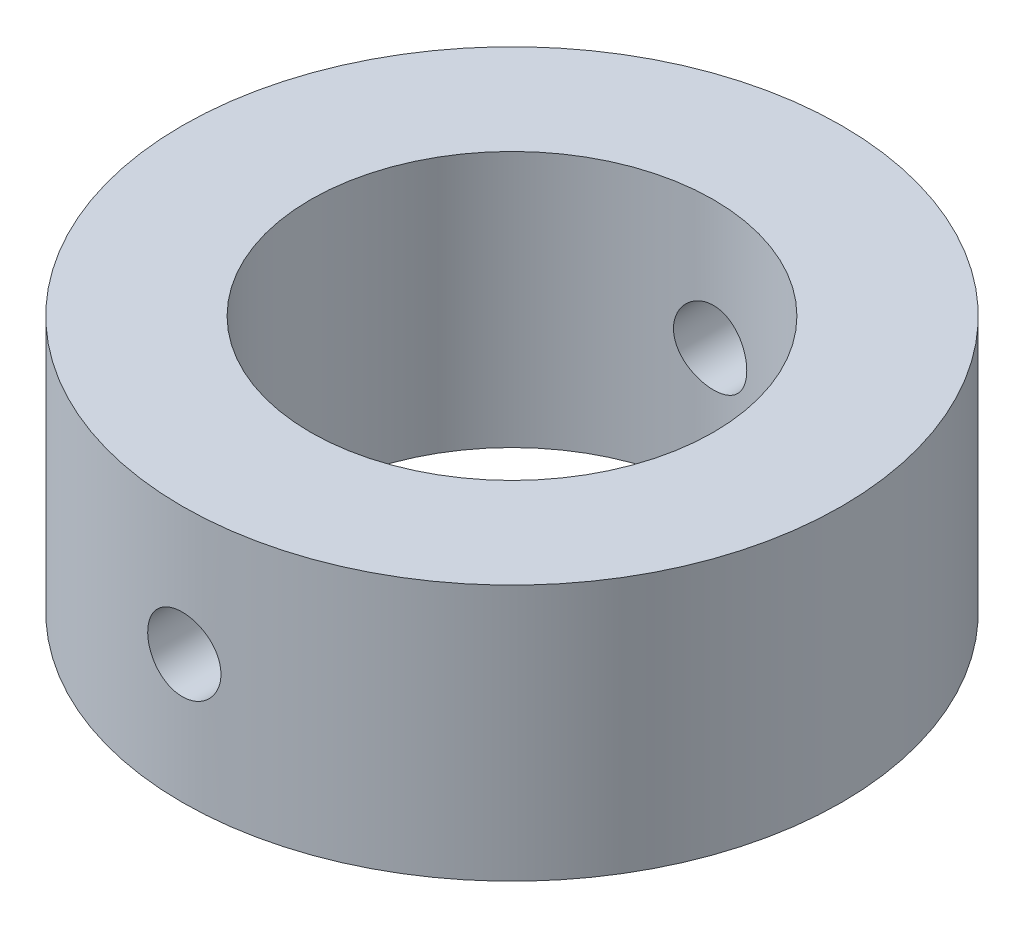
ISO-10303-21;
HEADER;
FILE_DESCRIPTION(('STEP AP214'),'2;1');
FILE_NAME('part.step','',(''),(''),'','','');
FILE_SCHEMA(('AUTOMOTIVE_DESIGN { 1 0 10303 214 1 1 1 1 }'));
ENDSEC;
DATA;
#1=APPLICATION_CONTEXT('core data for automotive mechanical design processes');
#2=APPLICATION_PROTOCOL_DEFINITION('international standard','automotive_design',2000,#1);
#3=PRODUCT_CONTEXT('',#1,'mechanical');
#4=PRODUCT('Part','Part','',(#3));
#5=PRODUCT_RELATED_PRODUCT_CATEGORY('part','',(#4));
#6=PRODUCT_DEFINITION_FORMATION('','',#4);
#7=PRODUCT_DEFINITION_CONTEXT('part definition',#1,'design');
#8=PRODUCT_DEFINITION('design','',#6,#7);
#9=PRODUCT_DEFINITION_SHAPE('','',#8);
#10=(LENGTH_UNIT() NAMED_UNIT(*) SI_UNIT(.MILLI.,.METRE.));
#11=(NAMED_UNIT(*) PLANE_ANGLE_UNIT() SI_UNIT($,.RADIAN.));
#12=(NAMED_UNIT(*) SI_UNIT($,.STERADIAN.) SOLID_ANGLE_UNIT());
#13=UNCERTAINTY_MEASURE_WITH_UNIT(LENGTH_MEASURE(1.E-05),#10,'distance_accuracy_value','');
#14=(GEOMETRIC_REPRESENTATION_CONTEXT(3) GLOBAL_UNCERTAINTY_ASSIGNED_CONTEXT((#13)) GLOBAL_UNIT_ASSIGNED_CONTEXT((#10,
#11,#12)) REPRESENTATION_CONTEXT('',''));
#15=CARTESIAN_POINT('',(0.,0.,0.));
#16=DIRECTION('',(0.,0.,1.));
#17=DIRECTION('',(1.,0.,0.));
#18=AXIS2_PLACEMENT_3D('',#15,#16,#17);
#19=CARTESIAN_POINT('',(0.,17.5538461538461,0.));
#20=DIRECTION('',(0.,1.,0.));
#21=DIRECTION('',(0.,0.,1.));
#22=AXIS2_PLACEMENT_3D('',#19,#20,#21);
#23=CYLINDRICAL_SURFACE('',#22,18.);
#24=CARTESIAN_POINT('',(0.,-2.,18.));
#25=CARTESIAN_POINT('',(-0.111970632349519,-1.99999518717274,17.9999985855436));
#26=CARTESIAN_POINT('',(-0.22401360296951,-1.99056525489512,17.9989441411048));
#27=CARTESIAN_POINT('',(-0.444988473846702,-1.95309247157582,17.9948391595619));
#28=CARTESIAN_POINT('',(-0.553916889117786,-1.92502956094916,17.9917864712715));
#29=CARTESIAN_POINT('',(-0.765431079070291,-1.85112204481784,17.9840293073923));
#30=CARTESIAN_POINT('',(-0.868020820737628,-1.8052886941403,17.9793258774716));
#31=CARTESIAN_POINT('',(-1.06403053009986,-1.69716438580146,17.9687919810869));
#32=CARTESIAN_POINT('',(-1.1574522117349,-1.63487651233084,17.9629617258869));
#33=CARTESIAN_POINT('',(-1.33290575747026,-1.49531794987183,17.9507977181856));
#34=CARTESIAN_POINT('',(-1.4148915795421,-1.41798953514322,17.9444620831364));
#35=CARTESIAN_POINT('',(-1.56475003710051,-1.2506685239635,17.9320167832537));
#36=CARTESIAN_POINT('',(-1.63262199299226,-1.16067531804146,17.9259071293129));
#37=CARTESIAN_POINT('',(-1.7524930181623,-0.970286071769773,17.9145866794937));
#38=CARTESIAN_POINT('',(-1.80444975542339,-0.869863222950149,17.9093782965755));
#39=CARTESIAN_POINT('',(-1.89074517800796,-0.661650539312929,17.9004741803531));
#40=CARTESIAN_POINT('',(-1.92508439501976,-0.553860926931999,17.8967784014));
#41=CARTESIAN_POINT('',(-1.97503194492644,-0.334448002135696,17.8913354423153));
#42=CARTESIAN_POINT('',(-1.99071729842217,-0.222842424929062,17.8895802517469));
#43=CARTESIAN_POINT('',(-2.00315006003506,0.00142986183008502,17.8881925066123));
#44=CARTESIAN_POINT('',(-1.99989807564483,0.114096537227774,17.8885598839559));
#45=CARTESIAN_POINT('',(-1.97461184427901,0.336759474971588,17.891368441014));
#46=CARTESIAN_POINT('',(-1.95266200172973,0.446765456674598,17.8938003012309));
#47=CARTESIAN_POINT('',(-1.89073461157689,0.661522625388757,17.9004492717341));
#48=CARTESIAN_POINT('',(-1.85075676930152,0.766273726476568,17.904666411201));
#49=CARTESIAN_POINT('',(-1.75381606079451,0.967812423163108,17.9144214425039));
#50=CARTESIAN_POINT('',(-1.6968160688148,1.06458201601582,17.9199622158801));
#51=CARTESIAN_POINT('',(-1.56747570663675,1.24721365073087,17.9317378723191));
#52=CARTESIAN_POINT('',(-1.49513478176794,1.33307529802335,17.9379727804753));
#53=CARTESIAN_POINT('',(-1.33669614893956,1.49194398430861,17.9504756897929));
#54=CARTESIAN_POINT('',(-1.25052560566827,1.56487840522475,17.9567436860931));
#55=CARTESIAN_POINT('',(-1.06712581996098,1.69525838167234,17.9685745710182));
#56=CARTESIAN_POINT('',(-0.969896560277035,1.75270391304576,17.9741374585434));
#57=CARTESIAN_POINT('',(-0.767086635535504,1.85047376476476,17.9839338102592));
#58=CARTESIAN_POINT('',(-0.661504004801704,1.89079404097506,17.9881669603705));
#59=CARTESIAN_POINT('',(-0.445009755639361,1.95311377504167,17.9948238450129));
#60=CARTESIAN_POINT('',(-0.334098334257908,1.97511390978633,17.997247646395));
#61=CARTESIAN_POINT('',(-0.110723331894269,2.00007590171753,18.0000041106556));
#62=CARTESIAN_POINT('',(0.00172892889089294,2.00313789379621,18.0003477720089));
#63=CARTESIAN_POINT('',(0.225544988687161,1.99040020748693,17.998934812043));
#64=CARTESIAN_POINT('',(0.33690880589132,1.97460084490708,17.9971782258895));
#65=CARTESIAN_POINT('',(0.555095059423331,1.92467205954415,17.9917690933051));
#66=CARTESIAN_POINT('',(0.661928438561836,1.89058988188252,17.9881214344582));
#67=CARTESIAN_POINT('',(0.868362270126896,1.80511172227189,17.9793390034163));
#68=CARTESIAN_POINT('',(0.967962524792293,1.75371526714897,17.9742041905801));
#69=CARTESIAN_POINT('',(1.15755326511746,1.63482170892903,17.9629935700227));
#70=CARTESIAN_POINT('',(1.24750253139102,1.56725923906018,17.9569139780361));
#71=CARTESIAN_POINT('',(1.41481983480219,1.41804470166563,17.9445071585437));
#72=CARTESIAN_POINT('',(1.49218748015557,1.33639219554766,17.938179923334));
#73=CARTESIAN_POINT('',(1.63249622432816,1.16087671093394,17.925957484036));
#74=CARTESIAN_POINT('',(1.69537132537921,1.06696080952172,17.920064336427));
#75=CARTESIAN_POINT('',(1.80445556005008,0.869843716507564,17.9094097287311));
#76=CARTESIAN_POINT('',(1.85066496700075,0.766642677224086,17.9046482500845));
#77=CARTESIAN_POINT('',(1.92499712101143,0.554105541283379,17.8968094822665));
#78=CARTESIAN_POINT('',(1.95315827481128,0.44478301425242,17.8937286188355));
#79=CARTESIAN_POINT('',(1.99071877766797,0.222924852258367,17.8895891957456));
#80=CARTESIAN_POINT('',(2.00011880320655,0.11038933329655,17.8885305631698));
#81=CARTESIAN_POINT('',(1.99987957341679,-0.114044155065053,17.8885572584665));
#82=CARTESIAN_POINT('',(1.99034399043058,-0.225942250680951,17.8896309120887));
#83=CARTESIAN_POINT('',(1.9527225008048,-0.446535738325604,17.8937762295707));
#84=CARTESIAN_POINT('',(1.92463658036714,-0.555231127972063,17.8968478949167));
#85=CARTESIAN_POINT('',(1.85074191262564,-0.766327510509217,17.9046397451111));
#86=CARTESIAN_POINT('',(1.80493703938195,-0.868729873635424,17.9093595695852));
#87=CARTESIAN_POINT('',(1.69691508787252,-1.0644104934481,17.9199166120206));
#88=CARTESIAN_POINT('',(1.63469797623759,-1.15768873158296,17.9257538322538));
#89=CARTESIAN_POINT('',(1.49522995253707,-1.33300424612643,17.9379262794022));
#90=CARTESIAN_POINT('',(1.41790170900318,-1.41497983547593,17.944263963574));
#91=CARTESIAN_POINT('',(1.25056419248413,-1.5648338722108,17.9567010614173));
#92=CARTESIAN_POINT('',(1.16055190760651,-1.63270896185917,17.962800418056));
#93=CARTESIAN_POINT('',(0.970094486774868,-1.75260433035013,17.9740935209669));
#94=CARTESIAN_POINT('',(0.869618446416091,-1.80457574973094,17.9792844558708));
#95=CARTESIAN_POINT('',(0.66136849516123,-1.89083749244483,17.9881463543356));
#96=CARTESIAN_POINT('',(0.55360283994444,-1.92514745073418,17.9918190049356));
#97=CARTESIAN_POINT('',(0.371040239312598,-1.96669916146577,17.9963232552591));
#98=CARTESIAN_POINT('',(0.297404134861362,-1.97916954843922,17.9976954860037));
#99=CARTESIAN_POINT('',(0.149189389902707,-1.99582154886399,17.9995343271896));
#100=CARTESIAN_POINT('',(0.0746107544775069,-2.00000320698978,18.000000942512));
#101=CARTESIAN_POINT('',(0.,-2.,18.));
#102=B_SPLINE_CURVE_WITH_KNOTS('',3,(#24,#25,#26,#27,#28,#29,#30,#31,#32,#33,#34,#35,#36,#37,
#38,#39,#40,#41,#42,#43,#44,#45,#46,#47,#48,#49,#50,#51,#52,#53,#54,#55,#56,#57,#58,#59,#60,#61,
#62,#63,#64,#65,#66,#67,#68,#69,#70,#71,#72,#73,#74,#75,#76,#77,#78,#79,#80,#81,#82,#83,#84,#85,
#86,#87,#88,#89,#90,#91,#92,#93,#94,#95,#96,#97,#98,#99,#100,#101),.UNSPECIFIED.,.T.,.F.,(4,2,2,
2,2,2,2,2,2,2,2,2,2,2,2,2,2,2,2,2,2,2,2,2,2,2,2,2,2,2,2,2,2,2,2,2,2,2,4),(0.,0.335639414270807,
0.671640752838988,1.00742963320074,1.34315561881719,1.68019649784365,2.01725360192296,
2.35519959306228,2.69313538455338,3.02967096220247,3.36619574415512,3.70120941343134,
4.03622855878184,4.37198379333011,4.70775116959619,5.0453487253329,5.3829468076176,
5.72062456954608,6.05828985448105,6.39416820670407,6.73004093517319,7.06504987759405,
7.40006797606269,7.73646430887643,8.07287111486782,8.41078088557856,8.74868511404414,
9.08586787252136,9.42303847276942,9.75836815539861,10.0936980874527,10.4289547445926,
10.7642120833782,11.1012322946639,11.4383326684529,11.7764585228658,12.1142076528796,
12.3378595549845,12.5615102516508),.UNSPECIFIED.);
#103=CARTESIAN_POINT('',(0.,-2.,18.));
#104=VERTEX_POINT('',#103);
#105=EDGE_CURVE('E92',#104,#104,#102,.T.);
#106=ORIENTED_EDGE('',*,*,#105,.T.);
#107=EDGE_LOOP('',(#106));
#108=FACE_BOUND('',#107,.T.);
#109=CARTESIAN_POINT('',(2.,0.,-17.8885438199983));
#110=CARTESIAN_POINT('',(1.99999518503575,0.111968226954188,-17.8885452673513));
#111=CARTESIAN_POINT('',(1.99056564422495,0.22400879952899,-17.8896064083062));
#112=CARTESIAN_POINT('',(1.9530945571327,0.444978688113826,-17.8937353069379));
#113=CARTESIAN_POINT('',(1.92503294287933,0.553904517249662,-17.8968052281518));
#114=CARTESIAN_POINT('',(1.85112921882987,0.765413238050207,-17.9045997629771));
#115=CARTESIAN_POINT('',(1.80529842543048,0.868000118596708,-17.9093233232741));
#116=CARTESIAN_POINT('',(1.6971801398522,1.0640050312931,-17.9198916263535));
#117=CARTESIAN_POINT('',(1.63489572561389,1.15742477384015,-17.9257361593821));
#118=CARTESIAN_POINT('',(1.49534066211955,1.33288049818134,-17.9379170304468));
#119=CARTESIAN_POINT('',(1.41801151386004,1.41486982635829,-17.9442552283822));
#120=CARTESIAN_POINT('',(1.25068756201248,1.56473505390659,-17.956692464558));
#121=CARTESIAN_POINT('',(1.16069215853742,1.6326102844422,-17.9627914914535));
#122=CARTESIAN_POINT('',(0.970300975910865,1.75248474260362,-17.9740818874251));
#123=CARTESIAN_POINT('',(0.869878766261949,1.80444223723359,-17.9792708555609));
#124=CARTESIAN_POINT('',(0.661667471517998,1.89073923619886,-17.9881361419533));
#125=CARTESIAN_POINT('',(0.553878605135573,1.92507926333131,-17.9918125050956));
#126=CARTESIAN_POINT('',(0.334468008621896,1.97502849322176,-17.9972252779851));
#127=CARTESIAN_POINT('',(0.222864029559306,1.99071479178831,-17.9989696704928));
#128=CARTESIAN_POINT('',(-0.00140512478551102,2.00314999730295,-18.0003491557537));
#129=CARTESIAN_POINT('',(-0.114070266492344,1.99989950141874,-17.999984315021));
#130=CARTESIAN_POINT('',(-0.336739745879572,1.97461563521794,-17.9971929428148));
#131=CARTESIAN_POINT('',(-0.446753627473802,1.95266517064822,-17.9947755115965));
#132=CARTESIAN_POINT('',(-0.661526274498665,1.89073380147306,-17.9881609397357));
#133=CARTESIAN_POINT('',(-0.766284958137244,1.85075261633365,-17.983963771403));
#134=CARTESIAN_POINT('',(-0.967832879518122,1.75380496878332,-17.9742457977887));
#135=CARTESIAN_POINT('',(-1.06460449111718,1.69680215768824,-17.9687221649126));
#136=CARTESIAN_POINT('',(-1.2472389694308,1.56745576931318,-17.9569703102514));
#137=CARTESIAN_POINT('',(-1.33310144059904,1.49511163603744,-17.9507420629336));
#138=CARTESIAN_POINT('',(-1.49196653465317,1.33667071691282,-17.9382394115377));
#139=CARTESIAN_POINT('',(-1.56489718633274,1.25050175345599,-17.9319649398659));
#140=CARTESIAN_POINT('',(-1.69527030904771,1.06710647531464,-17.9201104242365));
#141=CARTESIAN_POINT('',(-1.75271274805118,0.969880137762416,-17.9145303817151));
#142=CARTESIAN_POINT('',(-1.85048037105374,0.767071026530246,-17.9046962899179));
#143=CARTESIAN_POINT('',(-1.89080055980943,0.661485824880405,-17.9004426276963));
#144=CARTESIAN_POINT('',(-1.95311933213687,0.444985984242083,-17.8937507545429));
#145=CARTESIAN_POINT('',(-1.97511860833,0.334071546892834,-17.891312474981));
#146=CARTESIAN_POINT('',(-2.00007735935568,0.11069510696495,-17.8885396347188));
#147=CARTESIAN_POINT('',(-2.00313777083876,-0.00175548459326164,-17.8881939216838));
#148=CARTESIAN_POINT('',(-1.99039751910215,-0.225567827031347,-17.8896159038576));
#149=CARTESIAN_POINT('',(-1.97459717180621,-0.336929596117845,-17.8913835636668));
#150=CARTESIAN_POINT('',(-1.92466859187558,-0.555105485339679,-17.8968229651343));
#151=CARTESIAN_POINT('',(-1.89058856475884,-0.661930772675792,-17.9004896978583));
#152=CARTESIAN_POINT('',(-1.80511741398991,-0.868349371183926,-17.9093100409564));
#153=CARTESIAN_POINT('',(-1.75372580444061,-0.967942479269591,-17.9144636930643));
#154=CARTESIAN_POINT('',(-1.63483941033055,-1.1575282931936,-17.9257040762847));
#155=CARTESIAN_POINT('',(-1.56727802875607,-1.24747900693807,-17.9317946280501));
#156=CARTESIAN_POINT('',(-1.41806481392953,-1.41479973723392,-17.9442102793975));
#157=CARTESIAN_POINT('',(-1.33641254922635,-1.49216936842207,-17.9505353861566));
#158=CARTESIAN_POINT('',(-1.16089620972329,-1.63248248532022,-17.9627413925405));
#159=CARTESIAN_POINT('',(-1.06697916673199,-1.69535992327816,-17.968620179616));
#160=CARTESIAN_POINT('',(-0.869859159636977,-1.80444825682681,-17.9792400807963));
#161=CARTESIAN_POINT('',(-0.766656348352902,-1.85065942663837,-17.9839812136192));
#162=CARTESIAN_POINT('',(-0.554120264945933,-1.92499272889714,-17.9917821449637));
#163=CARTESIAN_POINT('',(-0.444800831566823,-1.95315403200578,-17.9948455821934));
#164=CARTESIAN_POINT('',(-0.222949200757917,-1.99071588146752,-17.9989609669259));
#165=CARTESIAN_POINT('',(-0.110417116473332,-2.00011708770109,-18.0000129851797));
#166=CARTESIAN_POINT('',(0.114018334496894,-1.99988133626741,-17.9999868395735));
#167=CARTESIAN_POINT('',(0.225921823844598,-1.99034661842582,-17.9989201153349));
#168=CARTESIAN_POINT('',(0.446526316926466,-1.95272496321899,-17.9947989686735));
#169=CARTESIAN_POINT('',(0.555227319914946,-1.92463802153398,-17.9917445457879));
#170=CARTESIAN_POINT('',(0.766335076615752,-1.85073915596262,-17.9839899544047));
#171=CARTESIAN_POINT('',(0.86874317607688,-1.8049310371763,-17.9792901392271));
#172=CARTESIAN_POINT('',(1.06443391664963,-1.69690081603447,-17.9687671981842));
#173=CARTESIAN_POINT('',(1.15771654277213,-1.63467868671863,-17.9629440704738));
#174=CARTESIAN_POINT('',(1.33303189850074,-1.49520510358297,-17.9507882968297));
#175=CARTESIAN_POINT('',(1.41500385164123,-1.41787746860296,-17.9444531678765));
#176=CARTESIAN_POINT('',(1.56485083590747,-1.2505426709214,-17.9320080016661));
#177=CARTESIAN_POINT('',(1.63272249971267,-1.16053248806638,-17.9258980184622));
#178=CARTESIAN_POINT('',(1.75261413385152,-0.970076820326278,-17.9145748576723));
#179=CARTESIAN_POINT('',(1.80458464165387,-0.869600051342168,-17.9093644999484));
#180=CARTESIAN_POINT('',(1.89084447897051,-0.66134856315658,-17.9004638112766));
#181=CARTESIAN_POINT('',(1.92515345522498,-0.553582104730511,-17.8967717922482));
#182=CARTESIAN_POINT('',(1.96670243154842,-0.371022125055509,-17.8922425310128));
#183=CARTESIAN_POINT('',(1.97917158766845,-0.297389637680329,-17.8908622174332));
#184=CARTESIAN_POINT('',(1.99582195322212,-0.149182136930696,-17.8890123822324));
#185=CARTESIAN_POINT('',(2.00000320832675,-0.0746071287523425,-17.8885428555921));
#186=CARTESIAN_POINT('',(2.,0.,-17.8885438199983));
#187=B_SPLINE_CURVE_WITH_KNOTS('',3,(#109,#110,#111,#112,#113,#114,#115,#116,#117,#118,#119,
#120,#121,#122,#123,#124,#125,#126,#127,#128,#129,#130,#131,#132,#133,#134,#135,#136,#137,#138,
#139,#140,#141,#142,#143,#144,#145,#146,#147,#148,#149,#150,#151,#152,#153,#154,#155,#156,#157,
#158,#159,#160,#161,#162,#163,#164,#165,#166,#167,#168,#169,#170,#171,#172,#173,#174,#175,#176,
#177,#178,#179,#180,#181,#182,#183,#184,#185,#186),.UNSPECIFIED.,.T.,.F.,(4,2,2,2,2,2,2,2,2,2,2,
2,2,2,2,2,2,2,2,2,2,2,2,2,2,2,2,2,2,2,2,2,2,2,2,2,2,2,4),(0.,0.335632188624974,
0.671626462934656,1.00740710805003,1.34312498388733,1.68017531935543,2.01724162325253,
2.35518422792107,2.69311680358594,3.02964779613957,3.36616817631889,3.70120432175367,
4.03624568008393,4.37200767925155,4.70778184908852,5.04536979065502,5.3829584303983,
5.7206454906652,6.0583197841067,6.39419284630556,6.73006028260191,7.06504632328859,
7.40004176706191,7.73644141772486,8.07285137049336,8.41076545330537,8.74867397594563,
9.08584668590625,9.42300753571449,9.7583529180042,10.0936983783768,10.4289718731341,
10.7642459185884,11.1012566562892,11.4383477839705,11.7764770582129,12.1142293791938,
12.3378704296957,12.5615102478061),.UNSPECIFIED.);
#188=CARTESIAN_POINT('',(2.,0.,-17.8885438199983));
#189=VERTEX_POINT('',#188);
#190=EDGE_CURVE('E86',#189,#189,#187,.T.);
#191=ORIENTED_EDGE('',*,*,#190,.T.);
#192=EDGE_LOOP('',(#191));
#193=FACE_BOUND('',#192,.T.);
#194=CARTESIAN_POINT('',(0.,7.,0.));
#195=DIRECTION('',(0.,1.,0.));
#196=DIRECTION('',(0.,0.,1.));
#197=AXIS2_PLACEMENT_3D('',#194,#195,#196);
#198=CIRCLE('',#197,18.);
#199=CARTESIAN_POINT('',(0.,7.,18.));
#200=VERTEX_POINT('',#199);
#201=EDGE_CURVE('E10',#200,#200,#198,.T.);
#202=ORIENTED_EDGE('',*,*,#201,.F.);
#203=EDGE_LOOP('',(#202));
#204=FACE_BOUND('',#203,.T.);
#205=CARTESIAN_POINT('',(0.,-7.,0.));
#206=DIRECTION('',(0.,1.,0.));
#207=DIRECTION('',(0.,0.,1.));
#208=AXIS2_PLACEMENT_3D('',#205,#206,#207);
#209=CIRCLE('',#208,18.);
#210=CARTESIAN_POINT('',(0.,-7.,18.));
#211=VERTEX_POINT('',#210);
#212=EDGE_CURVE('E99',#211,#211,#209,.T.);
#213=ORIENTED_EDGE('',*,*,#212,.T.);
#214=EDGE_LOOP('',(#213));
#215=FACE_BOUND('',#214,.T.);
#216=ADVANCED_FACE('F43',(#108,#193,#204,#215),#23,.T.);
#217=CARTESIAN_POINT('',(11.,7.,0.));
#218=DIRECTION('',(0.,-1.,0.));
#219=DIRECTION('',(0.,0.,-1.));
#220=AXIS2_PLACEMENT_3D('',#217,#218,#219);
#221=PLANE('',#220);
#222=CARTESIAN_POINT('',(0.,7.,0.));
#223=DIRECTION('',(0.,1.,0.));
#224=DIRECTION('',(0.,0.,1.));
#225=AXIS2_PLACEMENT_3D('',#222,#223,#224);
#226=CIRCLE('',#225,11.);
#227=CARTESIAN_POINT('',(0.,7.,11.));
#228=VERTEX_POINT('',#227);
#229=EDGE_CURVE('E57',#228,#228,#226,.T.);
#230=ORIENTED_EDGE('',*,*,#229,.F.);
#231=EDGE_LOOP('',(#230));
#232=FACE_BOUND('',#231,.T.);
#233=ORIENTED_EDGE('',*,*,#201,.T.);
#234=EDGE_LOOP('',(#233));
#235=FACE_BOUND('',#234,.T.);
#236=ADVANCED_FACE('F109',(#232,#235),#221,.F.);
#237=CARTESIAN_POINT('',(0.,17.5538461538461,0.));
#238=DIRECTION('',(0.,1.,0.));
#239=DIRECTION('',(0.,0.,1.));
#240=AXIS2_PLACEMENT_3D('',#237,#238,#239);
#241=CYLINDRICAL_SURFACE('',#240,11.);
#242=CARTESIAN_POINT('',(0.,-2.,11.));
#243=CARTESIAN_POINT('',(0.111357271644373,-1.99999568133932,10.9999980072786));
#244=CARTESIAN_POINT('',(0.222771449918202,-1.99066824251735,10.9982915273343));
#245=CARTESIAN_POINT('',(0.442464406848309,-1.95362653397508,10.99164847502));
#246=CARTESIAN_POINT('',(0.550740387266074,-1.92589635141863,10.9867091072254));
#247=CARTESIAN_POINT('',(0.760947572513747,-1.85292287032901,10.9741532323507));
#248=CARTESIAN_POINT('',(0.862884263930176,-1.80769496781024,10.9665390793192));
#249=CARTESIAN_POINT('',(1.0577120033845,-1.70105266880821,10.949466714983));
#250=CARTESIAN_POINT('',(1.15060386767904,-1.63963973481181,10.9400086703132));
#251=CARTESIAN_POINT('',(1.32576444051238,-1.50163409035729,10.9201743349983));
#252=CARTESIAN_POINT('',(1.40791622603346,-1.42489415801924,10.9097897259708));
#253=CARTESIAN_POINT('',(1.55825357341079,-1.25872964591017,10.8893349521181));
#254=CARTESIAN_POINT('',(1.62643816794977,-1.16930418831085,10.8792648091126));
#255=CARTESIAN_POINT('',(1.74738695016477,-0.979487270540227,10.8604984020977));
#256=CARTESIAN_POINT('',(1.80003313265556,-0.879019464769625,10.851812871101));
#257=CARTESIAN_POINT('',(1.88765546949978,-0.670481349676033,10.836915832769));
#258=CARTESIAN_POINT('',(1.92263305283275,-0.562411655974962,10.8307041253674));
#259=CARTESIAN_POINT('',(1.97355197711315,-0.342985350643402,10.8215415351671));
#260=CARTESIAN_POINT('',(1.98969666425445,-0.231677408290375,10.8185558462234));
#261=CARTESIAN_POINT('',(2.00312248736688,-0.0078955926854322,10.8160783143231));
#262=CARTESIAN_POINT('',(2.00040521296643,0.104578181516031,10.8165861769405));
#263=CARTESIAN_POINT('',(1.97634934427,0.326031914133018,10.8210066504918));
#264=CARTESIAN_POINT('',(1.95524117699072,0.435037867895722,10.8248771281426));
#265=CARTESIAN_POINT('',(1.89536523340026,0.647935018367165,10.8355206127391));
#266=CARTESIAN_POINT('',(1.85659674743188,0.75182600935179,10.8422937363232));
#267=CARTESIAN_POINT('',(1.76227297789295,0.952222790778736,10.8580238155272));
#268=CARTESIAN_POINT('',(1.7066239037154,1.04868344266613,10.8669929171435));
#269=CARTESIAN_POINT('',(1.58018503374043,1.23098473694529,10.8860962201172));
#270=CARTESIAN_POINT('',(1.50939379023584,1.31682436264624,10.8962305328347));
#271=CARTESIAN_POINT('',(1.35343399418352,1.47677899644437,10.9167064080854));
#272=CARTESIAN_POINT('',(1.2680681726569,1.55070168843691,10.9270488181647));
#273=CARTESIAN_POINT('',(1.08604454069331,1.68320513348083,10.9466375043709));
#274=CARTESIAN_POINT('',(0.989386629498157,1.74178574962126,10.9558837707156));
#275=CARTESIAN_POINT('',(0.787327598497296,1.84196738978503,10.9722553782534));
#276=CARTESIAN_POINT('',(0.681916780395492,1.88354926869598,10.9793783255922));
#277=CARTESIAN_POINT('',(0.465448414462666,1.9483631924937,10.9906820547088));
#278=CARTESIAN_POINT('',(0.354391431316065,1.97159706857391,10.994863130091));
#279=CARTESIAN_POINT('',(0.131438649578499,1.99878976191912,10.9997719337866));
#280=CARTESIAN_POINT('',(0.0195760121089339,2.00301222345408,11.0005468934114));
#281=CARTESIAN_POINT('',(-0.203257238970967,1.99276820181851,10.998686302475));
#282=CARTESIAN_POINT('',(-0.314227893453082,1.97830257992826,10.9960509090871));
#283=CARTESIAN_POINT('',(-0.531297097592757,1.93131225043812,10.9876950863245));
#284=CARTESIAN_POINT('',(-0.637425297458317,1.89892013081717,10.9819973157216));
#285=CARTESIAN_POINT('',(-0.84274471375661,1.81713917147806,10.9681529512222));
#286=CARTESIAN_POINT('',(-0.941935480960949,1.7677492323023,10.9600061989244));
#287=CARTESIAN_POINT('',(-1.13169524707493,1.65278536219707,10.9420497958484));
#288=CARTESIAN_POINT('',(-1.22216445208488,1.58704931284408,10.932223816146));
#289=CARTESIAN_POINT('',(-1.39088213822347,1.4414796233289,10.9120428807109));
#290=CARTESIAN_POINT('',(-1.46912954974332,1.36164475058806,10.901687878785));
#291=CARTESIAN_POINT('',(-1.6121773788768,1.1889531185515,10.8814603955764));
#292=CARTESIAN_POINT('',(-1.67679836741418,1.09594669347414,10.8715955212189));
#293=CARTESIAN_POINT('',(-1.78949986552014,0.900243818593513,10.8536151008102));
#294=CARTESIAN_POINT('',(-1.83758096630795,0.797547715315616,10.8454994922354));
#295=CARTESIAN_POINT('',(-1.91557945241746,0.585849250308254,10.8319954461548));
#296=CARTESIAN_POINT('',(-1.9455810786184,0.476878769261946,10.8265943801675));
#297=CARTESIAN_POINT('',(-1.98683040178554,0.255337011368931,10.8191012654539));
#298=CARTESIAN_POINT('',(-1.99808007453629,0.142766115151078,10.8170088681136));
#299=CARTESIAN_POINT('',(-2.00144313663184,-0.0809853754636368,10.8163869388262));
#300=CARTESIAN_POINT('',(-1.99383937001232,-0.192161671438542,10.8178047454411));
#301=CARTESIAN_POINT('',(-1.96032846912815,-0.411623638017415,10.8239270874703));
#302=CARTESIAN_POINT('',(-1.93442142905718,-0.519909323494285,10.8286316059701));
#303=CARTESIAN_POINT('',(-1.86515567158476,-0.73037619739537,10.8407757208091));
#304=CARTESIAN_POINT('',(-1.82182581019232,-0.832567160223432,10.8482107929975));
#305=CARTESIAN_POINT('',(-1.71897473664823,-1.02827444716474,10.8649817751485));
#306=CARTESIAN_POINT('',(-1.65945247569007,-1.12179020884559,10.8743178082294));
#307=CARTESIAN_POINT('',(-1.52491543662799,-1.29891287459562,10.8940032465147));
#308=CARTESIAN_POINT('',(-1.44969415553099,-1.38236156987076,10.9043650783111));
#309=CARTESIAN_POINT('',(-1.28632651423364,-1.53554708101219,10.9248399206865));
#310=CARTESIAN_POINT('',(-1.19817718680093,-1.60528074039225,10.9349528735191));
#311=CARTESIAN_POINT('',(-1.0105711896463,-1.72960029712349,10.9538897429719));
#312=CARTESIAN_POINT('',(-0.911025849790496,-1.78405418518013,10.9627021317343));
#313=CARTESIAN_POINT('',(-0.704073905086344,-1.87537921607405,10.9779326099335));
#314=CARTESIAN_POINT('',(-0.59667492548667,-1.91226715927832,10.9843529858473));
#315=CARTESIAN_POINT('',(-0.407441749458405,-1.95977543030219,10.9927407037649));
#316=CARTESIAN_POINT('',(-0.326725427276489,-1.97483433296035,10.9954478027358));
#317=CARTESIAN_POINT('',(-0.164016342132202,-1.9949480937949,10.9990781643304));
#318=CARTESIAN_POINT('',(-0.0820236084408326,-2.00000318104177,11.0000014678));
#319=CARTESIAN_POINT('',(0.,-2.,11.));
#320=B_SPLINE_CURVE_WITH_KNOTS('',3,(#242,#243,#244,#245,#246,#247,#248,#249,#250,#251,#252,
#253,#254,#255,#256,#257,#258,#259,#260,#261,#262,#263,#264,#265,#266,#267,#268,#269,#270,#271,
#272,#273,#274,#275,#276,#277,#278,#279,#280,#281,#282,#283,#284,#285,#286,#287,#288,#289,#290,
#291,#292,#293,#294,#295,#296,#297,#298,#299,#300,#301,#302,#303,#304,#305,#306,#307,#308,#309,
#310,#311,#312,#313,#314,#315,#316,#317,#318,#319),.UNSPECIFIED.,.T.,.F.,(4,2,2,2,2,2,2,2,2,2,2,
2,2,2,2,2,2,2,2,2,2,2,2,2,2,2,2,2,2,2,2,2,2,2,2,2,2,2,4),(0.,0.333771891552332,0.66783277207259,
1.00160038286674,1.3353378446015,1.67245014596885,2.00958578663078,2.3492195220365,
2.6888257845573,3.02473021172645,3.36060633024202,3.69233367290895,4.02407434678871,
4.35769306461625,4.69134369321255,5.02993210441872,5.36852353704646,5.70749527023812,
6.04643316861453,6.38065600997364,6.71486344850797,7.0466314328543,7.3784208807422,
7.71364226795666,8.04889297616123,8.38831506130458,8.72772501252474,9.06554101076157,
9.40332141303601,9.73606509730371,10.0688070691931,10.4010002025896,10.733214857769,
11.0701111453004,11.4070848782946,11.7468860454293,12.0863615649817,12.3322171022956,
12.5780670098676),.UNSPECIFIED.);
#321=CARTESIAN_POINT('',(0.,-2.,11.));
#322=VERTEX_POINT('',#321);
#323=EDGE_CURVE('E47',#322,#322,#320,.T.);
#324=ORIENTED_EDGE('',*,*,#323,.T.);
#325=EDGE_LOOP('',(#324));
#326=FACE_BOUND('',#325,.T.);
#327=CARTESIAN_POINT('',(2.,0.,-10.816653826392));
#328=CARTESIAN_POINT('',(1.99999566748834,-0.11134012257296,-10.8166559469823));
#329=CARTESIAN_POINT('',(1.9906710042305,-0.222737191288005,-10.818391586416));
#330=CARTESIAN_POINT('',(1.953641319662,-0.442394615872969,-10.825138630904));
#331=CARTESIAN_POINT('',(1.92592032102069,-0.550652159669283,-10.8301528833982));
#332=CARTESIAN_POINT('',(1.85297369289719,-0.760820313018511,-10.8428709030557));
#333=CARTESIAN_POINT('',(1.80776389192774,-0.862736565308052,-10.8505722376174));
#334=CARTESIAN_POINT('',(1.70116425408316,-1.05752989162896,-10.8677937983012));
#335=CARTESIAN_POINT('',(1.6397758372698,-1.15040775801638,-10.8773138647657));
#336=CARTESIAN_POINT('',(1.50179524823966,-1.32558344744176,-10.8972247379328));
#337=CARTESIAN_POINT('',(1.4250503534781,-1.40776007423395,-10.9076236306456));
#338=CARTESIAN_POINT('',(1.25886539634161,-1.55814556283443,-10.9280489317643));
#339=CARTESIAN_POINT('',(1.1694245247635,-1.62635353364538,-10.9380753163763));
#340=CARTESIAN_POINT('',(0.979593418999866,-1.74732731845024,-10.9567122399244));
#341=CARTESIAN_POINT('',(0.879129490479886,-1.7999792699958,-10.965312146403));
#342=CARTESIAN_POINT('',(0.670599774437609,-1.88761333302614,-10.9800367733651));
#343=CARTESIAN_POINT('',(0.562534575326679,-1.92259681050937,-10.98616168519));
#344=CARTESIAN_POINT('',(0.343124837820858,-1.97352723325545,-10.9951891058833));
#345=CARTESIAN_POINT('',(0.231829128518768,-1.98967831432072,-10.9981261454525));
#346=CARTESIAN_POINT('',(0.00807147296592509,-2.0031211674624,-11.0005658088946));
#347=CARTESIAN_POINT('',(-0.104390378935038,-2.00041445357154,-11.0000687084839));
#348=CARTESIAN_POINT('',(-0.32588919614074,-1.97637585792208,-10.9957231855211));
#349=CARTESIAN_POINT('',(-0.434950900053349,-1.95526374648556,-10.9919143087691));
#350=CARTESIAN_POINT('',(-0.647957490603365,-1.8953608025385,-10.9814174690798));
#351=CARTESIAN_POINT('',(-0.751902198979603,-1.85656935461377,-10.974729405919));
#352=CARTESIAN_POINT('',(-0.952366225453847,-1.76219694022084,-10.9591592037236));
#353=CARTESIAN_POINT('',(-1.04884289251747,-1.70652735596616,-10.9502655302338));
#354=CARTESIAN_POINT('',(-1.23116763357293,-1.58004411007531,-10.9312689682172));
#355=CARTESIAN_POINT('',(-1.31701468769822,-1.50922899706451,-10.9211659638428));
#356=CARTESIAN_POINT('',(-1.47694445054394,-1.35325154542072,-10.9006990809284));
#357=CARTESIAN_POINT('',(-1.55083959404949,-1.26789698208101,-10.8903335415211));
#358=CARTESIAN_POINT('',(-1.68329271964166,-1.08590593607908,-10.8706496206858));
#359=CARTESIAN_POINT('',(-1.74185050296967,-0.989269307234742,-10.861331252829));
#360=CARTESIAN_POINT('',(-1.84201538249093,-0.787217489513175,-10.8447947340983));
#361=CARTESIAN_POINT('',(-1.88359655385222,-0.681789168360212,-10.8375798001274));
#362=CARTESIAN_POINT('',(-1.94840376886998,-0.465282550111631,-10.8261173347694));
#363=CARTESIAN_POINT('',(-1.97163175896676,-0.354204853488856,-10.8218694887144));
#364=CARTESIAN_POINT('',(-1.99880217851546,-0.13124019879459,-10.8168840409274));
#365=CARTESIAN_POINT('',(-2.00301348489165,-0.0193870673303634,-10.8160975038278));
#366=CARTESIAN_POINT('',(-1.9927505477885,0.203424550561076,-10.8179929515389));
#367=CARTESIAN_POINT('',(-1.97827717035788,0.314383078213963,-10.8206747755886));
#368=CARTESIAN_POINT('',(-1.93128609638897,0.531380344052283,-10.8291592937867));
#369=CARTESIAN_POINT('',(-1.89890818855376,0.637450384008028,-10.8349378000789));
#370=CARTESIAN_POINT('',(-1.81717497571878,0.842659718828443,-10.8489439080076));
#371=CARTESIAN_POINT('',(-1.76781848506108,0.941798529085677,-10.8571716806773));
#372=CARTESIAN_POINT('',(-1.65290586187994,1.13151919601525,-10.8752613415266));
#373=CARTESIAN_POINT('',(-1.58717917941567,1.22199611808438,-10.8851400484298));
#374=CARTESIAN_POINT('',(-1.44162304950736,1.39073369159775,-10.9053706629202));
#375=CARTESIAN_POINT('',(-1.36179241301324,1.46899331199966,-10.91572261035));
#376=CARTESIAN_POINT('',(-1.18909630007261,1.61207284614979,-10.9358898604531));
#377=CARTESIAN_POINT('',(-1.09608023252376,1.6767123553618,-10.9456968282676));
#378=CARTESIAN_POINT('',(-0.900352619793527,1.789446306083,-10.9635308137777));
#379=CARTESIAN_POINT('',(-0.797641432067847,1.83754135727717,-10.9715578970606));
#380=CARTESIAN_POINT('',(-0.585948218345343,1.91554803863644,-10.9848917263157));
#381=CARTESIAN_POINT('',(-0.477000329353951,1.94554990487653,-10.9902119510479));
#382=CARTESIAN_POINT('',(-0.25550664896348,1.98680734329716,-10.9975899747809));
#383=CARTESIAN_POINT('',(-0.14296121367923,1.99806476513671,-10.9996480956777));
#384=CARTESIAN_POINT('',(0.0807996190288177,2.00145252110552,-11.0002641421388));
#385=CARTESIAN_POINT('',(0.192010837925448,1.99385588848469,-10.9988720323112));
#386=CARTESIAN_POINT('',(0.411544538990867,1.96034705357606,-10.9928473390214));
#387=CARTESIAN_POINT('',(0.519867045363828,1.93443500480099,-10.9882147827193));
#388=CARTESIAN_POINT('',(0.730415433440433,1.86514309651073,-10.9762290690773));
#389=CARTESIAN_POINT('',(0.832650596646201,1.82179065462444,-10.96888018348));
#390=CARTESIAN_POINT('',(1.02843701194217,1.71888059719124,-10.9522592239203));
#391=CARTESIAN_POINT('',(1.12198772879735,1.65932198372258,-10.9429870315355));
#392=CARTESIAN_POINT('',(1.29911459753549,1.52474236143811,-10.9233859020729));
#393=CARTESIAN_POINT('',(1.38253889858449,1.44952330461567,-10.9130443794735));
#394=CARTESIAN_POINT('',(1.53567622355086,1.28617048330647,-10.8925517029222));
#395=CARTESIAN_POINT('',(1.60538602436339,1.19803369143839,-10.8824005942262));
#396=CARTESIAN_POINT('',(1.72967671803608,1.01044032439889,-10.8633428283932));
#397=CARTESIAN_POINT('',(1.78412208501856,0.910892760688651,-10.8544476470463));
#398=CARTESIAN_POINT('',(1.87543058906983,0.703936723274017,-10.8390461745677));
#399=CARTESIAN_POINT('',(1.9123105996278,0.596535908392186,-10.8325375922296));
#400=CARTESIAN_POINT('',(1.95979896205519,0.407323315567744,-10.8240281075057));
#401=CARTESIAN_POINT('',(1.97484899189766,0.326630737391384,-10.821278872104));
#402=CARTESIAN_POINT('',(1.99495098425024,0.163969047967817,-10.8175909727573));
#403=CARTESIAN_POINT('',(2.00000319081575,0.0819999679303415,-10.8166522646159));
#404=CARTESIAN_POINT('',(2.,0.,-10.816653826392));
#405=B_SPLINE_CURVE_WITH_KNOTS('',3,(#327,#328,#329,#330,#331,#332,#333,#334,#335,#336,#337,
#338,#339,#340,#341,#342,#343,#344,#345,#346,#347,#348,#349,#350,#351,#352,#353,#354,#355,#356,
#357,#358,#359,#360,#361,#362,#363,#364,#365,#366,#367,#368,#369,#370,#371,#372,#373,#374,#375,
#376,#377,#378,#379,#380,#381,#382,#383,#384,#385,#386,#387,#388,#389,#390,#391,#392,#393,#394,
#395,#396,#397,#398,#399,#400,#401,#402,#403,#404),.UNSPECIFIED.,.T.,.F.,(4,2,2,2,2,2,2,2,2,2,2,
2,2,2,2,2,2,2,2,2,2,2,2,2,2,2,2,2,2,2,2,2,2,2,2,2,2,2,4),(0.,0.333720352628771,
0.667730923425361,1.00143989738151,1.33511959011685,1.6722993511526,2.00950061266478,
2.34911212511978,2.6886973772514,3.02456639415963,3.3604084455173,3.69229445292967,
4.02419201411038,4.3578632848798,4.69156654523441,5.03008350848145,5.36860485839155,
5.70764124486732,6.04664167012788,6.38083364646979,6.71501013332593,7.04661365662176,
7.37824034134339,7.71347820234125,8.04874433945132,8.38820522569594,8.72765360102077,
9.06539473675368,9.40310254298626,9.73594847886932,10.0687916249998,10.4011135484041,
10.7334559397116,11.0702887970716,11.4072007206838,11.7470154829573,12.0865031534681,
12.3322881015162,12.5780670496697),.UNSPECIFIED.);
#406=CARTESIAN_POINT('',(2.,0.,-10.816653826392));
#407=VERTEX_POINT('',#406);
#408=EDGE_CURVE('E66',#407,#407,#405,.T.);
#409=ORIENTED_EDGE('',*,*,#408,.T.);
#410=EDGE_LOOP('',(#409));
#411=FACE_BOUND('',#410,.T.);
#412=CARTESIAN_POINT('',(0.,-7.,0.));
#413=DIRECTION('',(0.,1.,0.));
#414=DIRECTION('',(0.,0.,1.));
#415=AXIS2_PLACEMENT_3D('',#412,#413,#414);
#416=CIRCLE('',#415,11.);
#417=CARTESIAN_POINT('',(0.,-7.,11.));
#418=VERTEX_POINT('',#417);
#419=EDGE_CURVE('E63',#418,#418,#416,.T.);
#420=ORIENTED_EDGE('',*,*,#419,.F.);
#421=EDGE_LOOP('',(#420));
#422=FACE_BOUND('',#421,.T.);
#423=ORIENTED_EDGE('',*,*,#229,.T.);
#424=EDGE_LOOP('',(#423));
#425=FACE_BOUND('',#424,.T.);
#426=ADVANCED_FACE('F72',(#326,#411,#422,#425),#241,.F.);
#427=CARTESIAN_POINT('',(11.,-7.,0.));
#428=DIRECTION('',(0.,1.,0.));
#429=DIRECTION('',(0.,0.,1.));
#430=AXIS2_PLACEMENT_3D('',#427,#428,#429);
#431=PLANE('',#430);
#432=ORIENTED_EDGE('',*,*,#212,.F.);
#433=EDGE_LOOP('',(#432));
#434=FACE_BOUND('',#433,.T.);
#435=ORIENTED_EDGE('',*,*,#419,.T.);
#436=EDGE_LOOP('',(#435));
#437=FACE_BOUND('',#436,.T.);
#438=ADVANCED_FACE('F80',(#434,#437),#431,.F.);
#439=CARTESIAN_POINT('',(0.,0.,-33.));
#440=DIRECTION('',(0.,0.,1.));
#441=DIRECTION('',(1.,0.,0.));
#442=AXIS2_PLACEMENT_3D('',#439,#440,#441);
#443=CYLINDRICAL_SURFACE('',#442,2.);
#444=ORIENTED_EDGE('',*,*,#408,.F.);
#445=EDGE_LOOP('',(#444));
#446=FACE_BOUND('',#445,.T.);
#447=ORIENTED_EDGE('',*,*,#190,.F.);
#448=EDGE_LOOP('',(#447));
#449=FACE_BOUND('',#448,.T.);
#450=ADVANCED_FACE('F78',(#446,#449),#443,.F.);
#451=ORIENTED_EDGE('',*,*,#323,.F.);
#452=EDGE_LOOP('',(#451));
#453=FACE_BOUND('',#452,.T.);
#454=ORIENTED_EDGE('',*,*,#105,.F.);
#455=EDGE_LOOP('',(#454));
#456=FACE_BOUND('',#455,.T.);
#457=ADVANCED_FACE('F75',(#453,#456),#443,.F.);
#458=CLOSED_SHELL('',(#216,#236,#426,#438,#450,#457));
#459=MANIFOLD_SOLID_BREP('B2',#458);
#460=ADVANCED_BREP_SHAPE_REPRESENTATION('',(#18,#459),#14);
#461=SHAPE_DEFINITION_REPRESENTATION(#9,#460);
ENDSEC;
END-ISO-10303-21;
